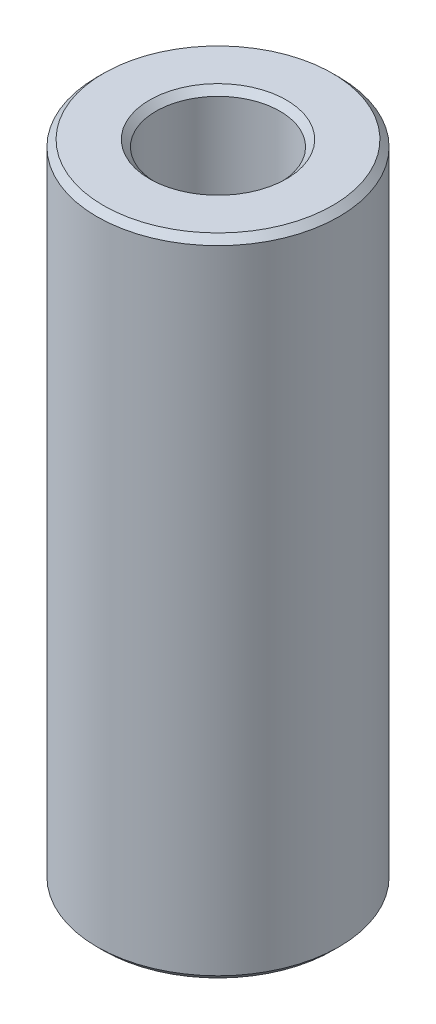
ISO-10303-21;
HEADER;
FILE_DESCRIPTION(('STEP AP214'),'2;1');
FILE_NAME('part.step','',(''),(''),'','','');
FILE_SCHEMA(('AUTOMOTIVE_DESIGN { 1 0 10303 214 1 1 1 1 }'));
ENDSEC;
DATA;
#1=APPLICATION_CONTEXT('core data for automotive mechanical design processes');
#2=APPLICATION_PROTOCOL_DEFINITION('international standard','automotive_design',2000,#1);
#3=PRODUCT_CONTEXT('',#1,'mechanical');
#4=PRODUCT('Part','Part','',(#3));
#5=PRODUCT_RELATED_PRODUCT_CATEGORY('part','',(#4));
#6=PRODUCT_DEFINITION_FORMATION('','',#4);
#7=PRODUCT_DEFINITION_CONTEXT('part definition',#1,'design');
#8=PRODUCT_DEFINITION('design','',#6,#7);
#9=PRODUCT_DEFINITION_SHAPE('','',#8);
#10=(LENGTH_UNIT() NAMED_UNIT(*) SI_UNIT(.MILLI.,.METRE.));
#11=(NAMED_UNIT(*) PLANE_ANGLE_UNIT() SI_UNIT($,.RADIAN.));
#12=(NAMED_UNIT(*) SI_UNIT($,.STERADIAN.) SOLID_ANGLE_UNIT());
#13=UNCERTAINTY_MEASURE_WITH_UNIT(LENGTH_MEASURE(1.E-05),#10,'distance_accuracy_value','');
#14=(GEOMETRIC_REPRESENTATION_CONTEXT(3) GLOBAL_UNCERTAINTY_ASSIGNED_CONTEXT((#13)) GLOBAL_UNIT_ASSIGNED_CONTEXT((#10,
#11,#12)) REPRESENTATION_CONTEXT('',''));
#15=CARTESIAN_POINT('',(0.,0.,0.));
#16=DIRECTION('',(0.,0.,1.));
#17=DIRECTION('',(1.,0.,0.));
#18=AXIS2_PLACEMENT_3D('',#15,#16,#17);
#19=CARTESIAN_POINT('',(0.,25.4,0.));
#20=DIRECTION('',(0.,-1.,0.));
#21=DIRECTION('',(0.,0.,-1.));
#22=AXIS2_PLACEMENT_3D('',#19,#20,#21);
#23=CONICAL_SURFACE('',#22,4.5085,0.78539816339745);
#24=CARTESIAN_POINT('',(0.,25.4,0.));
#25=DIRECTION('',(0.,1.,0.));
#26=DIRECTION('',(0.,0.,1.));
#27=AXIS2_PLACEMENT_3D('',#24,#25,#26);
#28=CIRCLE('',#27,4.5085);
#29=CARTESIAN_POINT('',(0.,25.4,4.5085));
#30=VERTEX_POINT('',#29);
#31=EDGE_CURVE('E69',#30,#30,#28,.T.);
#32=ORIENTED_EDGE('',*,*,#31,.F.);
#33=EDGE_LOOP('',(#32));
#34=FACE_BOUND('',#33,.T.);
#35=CARTESIAN_POINT('',(0.,25.146,0.));
#36=DIRECTION('',(0.,-1.,0.));
#37=DIRECTION('',(0.,0.,1.));
#38=AXIS2_PLACEMENT_3D('',#35,#36,#37);
#39=CIRCLE('',#38,4.7625);
#40=CARTESIAN_POINT('',(0.,25.146,4.7625));
#41=VERTEX_POINT('',#40);
#42=EDGE_CURVE('E87',#41,#41,#39,.T.);
#43=ORIENTED_EDGE('',*,*,#42,.F.);
#44=EDGE_LOOP('',(#43));
#45=FACE_BOUND('',#44,.T.);
#46=ADVANCED_FACE('F17',(#34,#45),#23,.T.);
#47=CARTESIAN_POINT('',(0.,0.254,0.));
#48=DIRECTION('',(0.,1.,0.));
#49=DIRECTION('',(0.,0.,1.));
#50=AXIS2_PLACEMENT_3D('',#47,#48,#49);
#51=CONICAL_SURFACE('',#50,4.7625,0.785398163397457);
#52=CARTESIAN_POINT('',(0.,0.,0.));
#53=DIRECTION('',(0.,-1.,0.));
#54=DIRECTION('',(0.,0.,1.));
#55=AXIS2_PLACEMENT_3D('',#52,#53,#54);
#56=CIRCLE('',#55,4.5085);
#57=CARTESIAN_POINT('',(0.,0.,4.5085));
#58=VERTEX_POINT('',#57);
#59=EDGE_CURVE('E79',#58,#58,#56,.T.);
#60=ORIENTED_EDGE('',*,*,#59,.F.);
#61=EDGE_LOOP('',(#60));
#62=FACE_BOUND('',#61,.T.);
#63=CARTESIAN_POINT('',(0.,0.254,0.));
#64=DIRECTION('',(0.,1.,0.));
#65=DIRECTION('',(0.,0.,1.));
#66=AXIS2_PLACEMENT_3D('',#63,#64,#65);
#67=CIRCLE('',#66,4.7625);
#68=CARTESIAN_POINT('',(0.,0.254,4.7625));
#69=VERTEX_POINT('',#68);
#70=EDGE_CURVE('E90',#69,#69,#67,.T.);
#71=ORIENTED_EDGE('',*,*,#70,.F.);
#72=EDGE_LOOP('',(#71));
#73=FACE_BOUND('',#72,.T.);
#74=ADVANCED_FACE('F174',(#62,#73),#51,.T.);
#75=CARTESIAN_POINT('',(0.,25.146,0.));
#76=DIRECTION('',(0.,1.,0.));
#77=DIRECTION('',(0.,0.,1.));
#78=AXIS2_PLACEMENT_3D('',#75,#76,#77);
#79=CONICAL_SURFACE('',#78,2.4384,0.785398163397442);
#80=CARTESIAN_POINT('',(0.,25.146,0.));
#81=DIRECTION('',(0.,1.,0.));
#82=DIRECTION('',(0.,0.,1.));
#83=AXIS2_PLACEMENT_3D('',#80,#81,#82);
#84=CIRCLE('',#83,2.4384);
#85=CARTESIAN_POINT('',(0.,25.146,2.4384));
#86=VERTEX_POINT('',#85);
#87=EDGE_CURVE('E25',#86,#86,#84,.T.);
#88=ORIENTED_EDGE('',*,*,#87,.F.);
#89=EDGE_LOOP('',(#88));
#90=FACE_BOUND('',#89,.T.);
#91=CARTESIAN_POINT('',(0.,25.4,0.));
#92=DIRECTION('',(0.,-1.,0.));
#93=DIRECTION('',(0.,0.,1.));
#94=AXIS2_PLACEMENT_3D('',#91,#92,#93);
#95=CIRCLE('',#94,2.6924);
#96=CARTESIAN_POINT('',(0.,25.4,2.6924));
#97=VERTEX_POINT('',#96);
#98=EDGE_CURVE('E73',#97,#97,#95,.T.);
#99=ORIENTED_EDGE('',*,*,#98,.F.);
#100=EDGE_LOOP('',(#99));
#101=FACE_BOUND('',#100,.T.);
#102=ADVANCED_FACE('F178',(#90,#101),#79,.F.);
#103=CARTESIAN_POINT('',(0.,0.,0.));
#104=DIRECTION('',(0.,-1.,0.));
#105=DIRECTION('',(0.,0.,-1.));
#106=AXIS2_PLACEMENT_3D('',#103,#104,#105);
#107=CONICAL_SURFACE('',#106,2.6924,0.785398163397435);
#108=CARTESIAN_POINT('',(0.,0.254000000000004,0.));
#109=DIRECTION('',(0.,-1.,0.));
#110=DIRECTION('',(0.,0.,1.));
#111=AXIS2_PLACEMENT_3D('',#108,#109,#110);
#112=CIRCLE('',#111,2.4384);
#113=CARTESIAN_POINT('',(0.,0.254000000000004,2.4384));
#114=VERTEX_POINT('',#113);
#115=EDGE_CURVE('E11',#114,#114,#112,.T.);
#116=ORIENTED_EDGE('',*,*,#115,.F.);
#117=EDGE_LOOP('',(#116));
#118=FACE_BOUND('',#117,.T.);
#119=CARTESIAN_POINT('',(0.,0.,0.));
#120=DIRECTION('',(0.,1.,0.));
#121=DIRECTION('',(0.,0.,1.));
#122=AXIS2_PLACEMENT_3D('',#119,#120,#121);
#123=CIRCLE('',#122,2.6924);
#124=CARTESIAN_POINT('',(0.,0.,2.6924));
#125=VERTEX_POINT('',#124);
#126=EDGE_CURVE('E84',#125,#125,#123,.T.);
#127=ORIENTED_EDGE('',*,*,#126,.F.);
#128=EDGE_LOOP('',(#127));
#129=FACE_BOUND('',#128,.T.);
#130=ADVANCED_FACE('F169',(#118,#129),#107,.F.);
#131=CARTESIAN_POINT('',(0.,25.4,0.));
#132=DIRECTION('',(0.,-1.,0.));
#133=DIRECTION('',(0.,0.,-1.));
#134=AXIS2_PLACEMENT_3D('',#131,#132,#133);
#135=CYLINDRICAL_SURFACE('',#134,2.4384);
#136=ORIENTED_EDGE('',*,*,#115,.T.);
#137=EDGE_LOOP('',(#136));
#138=FACE_BOUND('',#137,.T.);
#139=ORIENTED_EDGE('',*,*,#87,.T.);
#140=EDGE_LOOP('',(#139));
#141=FACE_BOUND('',#140,.T.);
#142=ADVANCED_FACE('F160',(#138,#141),#135,.F.);
#143=CARTESIAN_POINT('',(0.,25.4,0.));
#144=DIRECTION('',(0.,-1.,0.));
#145=DIRECTION('',(0.,0.,-1.));
#146=AXIS2_PLACEMENT_3D('',#143,#144,#145);
#147=CYLINDRICAL_SURFACE('',#146,4.7625);
#148=ORIENTED_EDGE('',*,*,#70,.T.);
#149=EDGE_LOOP('',(#148));
#150=FACE_BOUND('',#149,.T.);
#151=ORIENTED_EDGE('',*,*,#42,.T.);
#152=EDGE_LOOP('',(#151));
#153=FACE_BOUND('',#152,.T.);
#154=ADVANCED_FACE('F151',(#150,#153),#147,.T.);
#155=CARTESIAN_POINT('',(0.,0.,0.));
#156=DIRECTION('',(0.,1.,0.));
#157=DIRECTION('',(1.,0.,0.));
#158=AXIS2_PLACEMENT_3D('',#155,#156,#157);
#159=PLANE('',#158);
#160=ORIENTED_EDGE('',*,*,#126,.T.);
#161=EDGE_LOOP('',(#160));
#162=FACE_BOUND('',#161,.T.);
#163=ORIENTED_EDGE('',*,*,#59,.T.);
#164=EDGE_LOOP('',(#163));
#165=FACE_BOUND('',#164,.T.);
#166=ADVANCED_FACE('F143',(#162,#165),#159,.F.);
#167=CARTESIAN_POINT('',(0.,25.4,0.));
#168=DIRECTION('',(0.,1.,0.));
#169=DIRECTION('',(1.,0.,0.));
#170=AXIS2_PLACEMENT_3D('',#167,#168,#169);
#171=PLANE('',#170);
#172=ORIENTED_EDGE('',*,*,#98,.T.);
#173=EDGE_LOOP('',(#172));
#174=FACE_BOUND('',#173,.T.);
#175=ORIENTED_EDGE('',*,*,#31,.T.);
#176=EDGE_LOOP('',(#175));
#177=FACE_BOUND('',#176,.T.);
#178=ADVANCED_FACE('F70',(#174,#177),#171,.T.);
#179=CLOSED_SHELL('',(#46,#74,#102,#130,#142,#154,#166,#178));
#180=MANIFOLD_SOLID_BREP('B1',#179);
#181=ADVANCED_BREP_SHAPE_REPRESENTATION('',(#18,#180),#14);
#182=SHAPE_DEFINITION_REPRESENTATION(#9,#181);
ENDSEC;
END-ISO-10303-21;
